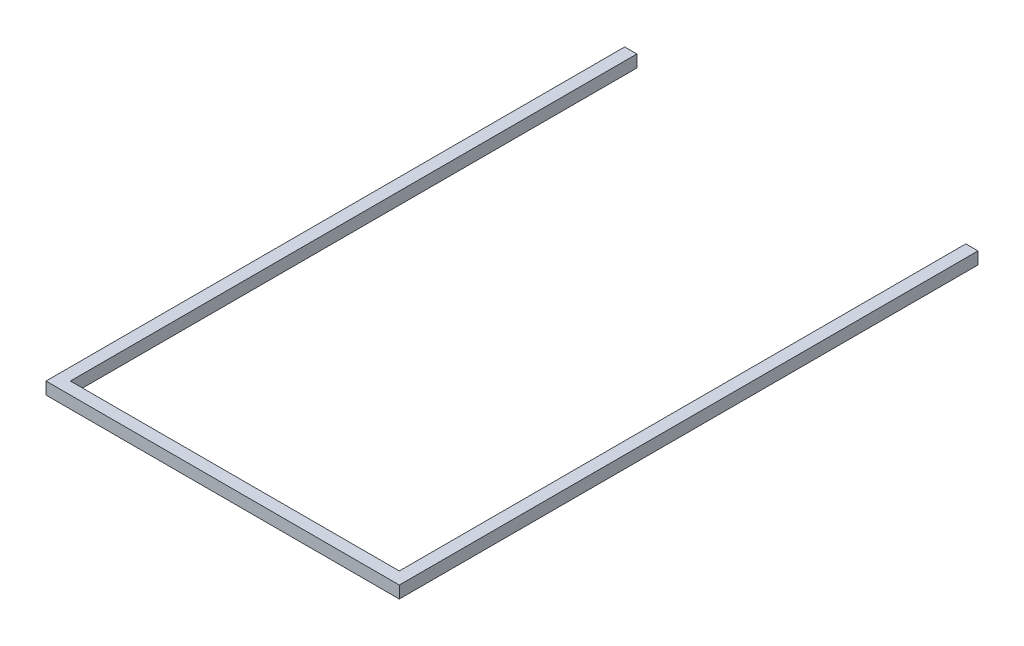
ISO-10303-21;
HEADER;
FILE_DESCRIPTION(('STEP AP214'),'2;1');
FILE_NAME('part.step','',(''),(''),'','','');
FILE_SCHEMA(('AUTOMOTIVE_DESIGN { 1 0 10303 214 1 1 1 1 }'));
ENDSEC;
DATA;
#1=APPLICATION_CONTEXT('core data for automotive mechanical design processes');
#2=APPLICATION_PROTOCOL_DEFINITION('international standard','automotive_design',2000,#1);
#3=PRODUCT_CONTEXT('',#1,'mechanical');
#4=PRODUCT('Part','Part','',(#3));
#5=PRODUCT_RELATED_PRODUCT_CATEGORY('part','',(#4));
#6=PRODUCT_DEFINITION_FORMATION('','',#4);
#7=PRODUCT_DEFINITION_CONTEXT('part definition',#1,'design');
#8=PRODUCT_DEFINITION('design','',#6,#7);
#9=PRODUCT_DEFINITION_SHAPE('','',#8);
#10=(LENGTH_UNIT() NAMED_UNIT(*) SI_UNIT(.MILLI.,.METRE.));
#11=(NAMED_UNIT(*) PLANE_ANGLE_UNIT() SI_UNIT($,.RADIAN.));
#12=(NAMED_UNIT(*) SI_UNIT($,.STERADIAN.) SOLID_ANGLE_UNIT());
#13=UNCERTAINTY_MEASURE_WITH_UNIT(LENGTH_MEASURE(1.E-05),#10,'distance_accuracy_value','');
#14=(GEOMETRIC_REPRESENTATION_CONTEXT(3) GLOBAL_UNCERTAINTY_ASSIGNED_CONTEXT((#13)) GLOBAL_UNIT_ASSIGNED_CONTEXT((#10,
#11,#12)) REPRESENTATION_CONTEXT('',''));
#15=CARTESIAN_POINT('',(0.,0.,0.));
#16=DIRECTION('',(0.,0.,1.));
#17=DIRECTION('',(1.,0.,0.));
#18=AXIS2_PLACEMENT_3D('',#15,#16,#17);
#19=CARTESIAN_POINT('',(-61.1442597325954,20.,-891.787813670094));
#20=DIRECTION('',(0.,0.,1.));
#21=DIRECTION('',(1.,0.,0.));
#22=AXIS2_PLACEMENT_3D('',#19,#20,#21);
#23=PLANE('',#22);
#24=DIRECTION('',(-1.,0.,0.));
#25=VECTOR('',#24,1.);
#26=CARTESIAN_POINT('',(-61.1442597325954,0.,-891.787813670094));
#27=LINE('',#26,#25);
#28=CARTESIAN_POINT('',(-61.1442597325954,0.,-891.787813670094));
#29=VERTEX_POINT('',#28);
#30=CARTESIAN_POINT('',(-81.1442597325955,0.,-891.787813670094));
#31=VERTEX_POINT('',#30);
#32=EDGE_CURVE('E129',#29,#31,#27,.T.);
#33=ORIENTED_EDGE('',*,*,#32,.T.);
#34=DIRECTION('',(0.,-1.,0.));
#35=VECTOR('',#34,1.);
#36=CARTESIAN_POINT('',(-81.1442597325955,20.,-891.787813670094));
#37=LINE('',#36,#35);
#38=CARTESIAN_POINT('',(-81.1442597325955,20.,-891.787813670094));
#39=VERTEX_POINT('',#38);
#40=EDGE_CURVE('E11',#39,#31,#37,.T.);
#41=ORIENTED_EDGE('',*,*,#40,.F.);
#42=DIRECTION('',(-1.,0.,0.));
#43=VECTOR('',#42,1.);
#44=CARTESIAN_POINT('',(-61.1442597325954,20.,-891.787813670094));
#45=LINE('',#44,#43);
#46=CARTESIAN_POINT('',(-61.1442597325954,20.,-891.787813670094));
#47=VERTEX_POINT('',#46);
#48=EDGE_CURVE('E143',#47,#39,#45,.T.);
#49=ORIENTED_EDGE('',*,*,#48,.F.);
#50=DIRECTION('',(0.,-1.,0.));
#51=VECTOR('',#50,1.);
#52=CARTESIAN_POINT('',(-61.1442597325954,20.,-891.787813670094));
#53=LINE('',#52,#51);
#54=EDGE_CURVE('E125',#47,#29,#53,.T.);
#55=ORIENTED_EDGE('',*,*,#54,.T.);
#56=EDGE_LOOP('',(#33,#41,#49,#55));
#57=FACE_BOUND('',#56,.T.);
#58=ADVANCED_FACE('F33',(#57),#23,.F.);
#59=CARTESIAN_POINT('',(-81.1442597325955,20.,-891.787813670094));
#60=DIRECTION('',(1.,0.,0.));
#61=DIRECTION('',(0.,0.,-1.));
#62=AXIS2_PLACEMENT_3D('',#59,#60,#61);
#63=PLANE('',#62);
#64=DIRECTION('',(0.,0.,1.));
#65=VECTOR('',#64,1.);
#66=CARTESIAN_POINT('',(-81.1442597325955,0.,-891.787813670094));
#67=LINE('',#66,#65);
#68=CARTESIAN_POINT('',(-81.1442597325954,0.,58.2121863299054));
#69=VERTEX_POINT('',#68);
#70=EDGE_CURVE('E132',#31,#69,#67,.T.);
#71=ORIENTED_EDGE('',*,*,#70,.T.);
#72=DIRECTION('',(0.,-1.,0.));
#73=VECTOR('',#72,1.);
#74=CARTESIAN_POINT('',(-81.1442597325954,20.,58.2121863299054));
#75=LINE('',#74,#73);
#76=CARTESIAN_POINT('',(-81.1442597325954,20.,58.2121863299054));
#77=VERTEX_POINT('',#76);
#78=EDGE_CURVE('E41',#77,#69,#75,.T.);
#79=ORIENTED_EDGE('',*,*,#78,.F.);
#80=DIRECTION('',(0.,0.,1.));
#81=VECTOR('',#80,1.);
#82=CARTESIAN_POINT('',(-81.1442597325955,20.,-891.787813670094));
#83=LINE('',#82,#81);
#84=EDGE_CURVE('E92',#39,#77,#83,.T.);
#85=ORIENTED_EDGE('',*,*,#84,.F.);
#86=ORIENTED_EDGE('',*,*,#40,.T.);
#87=EDGE_LOOP('',(#71,#79,#85,#86));
#88=FACE_BOUND('',#87,.T.);
#89=ADVANCED_FACE('F178',(#88),#63,.F.);
#90=CARTESIAN_POINT('',(-81.1442597325954,20.,58.2121863299054));
#91=DIRECTION('',(0.,0.,-1.));
#92=DIRECTION('',(-1.,0.,0.));
#93=AXIS2_PLACEMENT_3D('',#90,#91,#92);
#94=PLANE('',#93);
#95=DIRECTION('',(1.,0.,0.));
#96=VECTOR('',#95,1.);
#97=CARTESIAN_POINT('',(-81.1442597325954,0.,58.2121863299054));
#98=LINE('',#97,#96);
#99=CARTESIAN_POINT('',(498.855740267405,0.,58.2121863299054));
#100=VERTEX_POINT('',#99);
#101=EDGE_CURVE('E134',#69,#100,#98,.T.);
#102=ORIENTED_EDGE('',*,*,#101,.T.);
#103=DIRECTION('',(0.,-1.,0.));
#104=VECTOR('',#103,1.);
#105=CARTESIAN_POINT('',(498.855740267405,20.,58.2121863299054));
#106=LINE('',#105,#104);
#107=CARTESIAN_POINT('',(498.855740267405,20.,58.2121863299054));
#108=VERTEX_POINT('',#107);
#109=EDGE_CURVE('E150',#108,#100,#106,.T.);
#110=ORIENTED_EDGE('',*,*,#109,.F.);
#111=DIRECTION('',(1.,0.,0.));
#112=VECTOR('',#111,1.);
#113=CARTESIAN_POINT('',(-81.1442597325954,20.,58.2121863299054));
#114=LINE('',#113,#112);
#115=EDGE_CURVE('E158',#77,#108,#114,.T.);
#116=ORIENTED_EDGE('',*,*,#115,.F.);
#117=ORIENTED_EDGE('',*,*,#78,.T.);
#118=EDGE_LOOP('',(#102,#110,#116,#117));
#119=FACE_BOUND('',#118,.T.);
#120=ADVANCED_FACE('F156',(#119),#94,.F.);
#121=CARTESIAN_POINT('',(498.855740267405,20.,58.2121863299054));
#122=DIRECTION('',(-1.,0.,0.));
#123=DIRECTION('',(0.,0.,1.));
#124=AXIS2_PLACEMENT_3D('',#121,#122,#123);
#125=PLANE('',#124);
#126=DIRECTION('',(0.,0.,-1.));
#127=VECTOR('',#126,1.);
#128=CARTESIAN_POINT('',(498.855740267405,0.,58.2121863299054));
#129=LINE('',#128,#127);
#130=CARTESIAN_POINT('',(498.855740267405,0.,-891.787813670095));
#131=VERTEX_POINT('',#130);
#132=EDGE_CURVE('E136',#100,#131,#129,.T.);
#133=ORIENTED_EDGE('',*,*,#132,.T.);
#134=DIRECTION('',(0.,-1.,0.));
#135=VECTOR('',#134,1.);
#136=CARTESIAN_POINT('',(498.855740267405,20.,-891.787813670095));
#137=LINE('',#136,#135);
#138=CARTESIAN_POINT('',(498.855740267405,20.,-891.787813670095));
#139=VERTEX_POINT('',#138);
#140=EDGE_CURVE('E147',#139,#131,#137,.T.);
#141=ORIENTED_EDGE('',*,*,#140,.F.);
#142=DIRECTION('',(0.,0.,-1.));
#143=VECTOR('',#142,1.);
#144=CARTESIAN_POINT('',(498.855740267405,20.,58.2121863299054));
#145=LINE('',#144,#143);
#146=EDGE_CURVE('E170',#108,#139,#145,.T.);
#147=ORIENTED_EDGE('',*,*,#146,.F.);
#148=ORIENTED_EDGE('',*,*,#109,.T.);
#149=EDGE_LOOP('',(#133,#141,#147,#148));
#150=FACE_BOUND('',#149,.T.);
#151=ADVANCED_FACE('F166',(#150),#125,.F.);
#152=CARTESIAN_POINT('',(498.855740267405,20.,-891.787813670095));
#153=DIRECTION('',(0.,0.,1.));
#154=DIRECTION('',(1.,0.,0.));
#155=AXIS2_PLACEMENT_3D('',#152,#153,#154);
#156=PLANE('',#155);
#157=DIRECTION('',(-1.,0.,0.));
#158=VECTOR('',#157,1.);
#159=CARTESIAN_POINT('',(498.855740267405,0.,-891.787813670095));
#160=LINE('',#159,#158);
#161=CARTESIAN_POINT('',(478.855740267404,0.,-891.787813670095));
#162=VERTEX_POINT('',#161);
#163=EDGE_CURVE('E138',#131,#162,#160,.T.);
#164=ORIENTED_EDGE('',*,*,#163,.T.);
#165=DIRECTION('',(0.,-1.,0.));
#166=VECTOR('',#165,1.);
#167=CARTESIAN_POINT('',(478.855740267404,20.,-891.787813670095));
#168=LINE('',#167,#166);
#169=CARTESIAN_POINT('',(478.855740267404,20.,-891.787813670095));
#170=VERTEX_POINT('',#169);
#171=EDGE_CURVE('E120',#170,#162,#168,.T.);
#172=ORIENTED_EDGE('',*,*,#171,.F.);
#173=DIRECTION('',(-1.,0.,0.));
#174=VECTOR('',#173,1.);
#175=CARTESIAN_POINT('',(498.855740267405,20.,-891.787813670095));
#176=LINE('',#175,#174);
#177=EDGE_CURVE('E111',#139,#170,#176,.T.);
#178=ORIENTED_EDGE('',*,*,#177,.F.);
#179=ORIENTED_EDGE('',*,*,#140,.T.);
#180=EDGE_LOOP('',(#164,#172,#178,#179));
#181=FACE_BOUND('',#180,.T.);
#182=ADVANCED_FACE('F169',(#181),#156,.F.);
#183=CARTESIAN_POINT('',(478.855740267404,20.,-891.787813670095));
#184=DIRECTION('',(1.,0.,0.));
#185=DIRECTION('',(0.,0.,-1.));
#186=AXIS2_PLACEMENT_3D('',#183,#184,#185);
#187=PLANE('',#186);
#188=DIRECTION('',(0.,0.,1.));
#189=VECTOR('',#188,1.);
#190=CARTESIAN_POINT('',(478.855740267404,0.,-891.787813670095));
#191=LINE('',#190,#189);
#192=CARTESIAN_POINT('',(478.855740267405,0.,38.2121863299052));
#193=VERTEX_POINT('',#192);
#194=EDGE_CURVE('E119',#162,#193,#191,.T.);
#195=ORIENTED_EDGE('',*,*,#194,.T.);
#196=DIRECTION('',(0.,-1.,0.));
#197=VECTOR('',#196,1.);
#198=CARTESIAN_POINT('',(478.855740267405,20.,38.2121863299052));
#199=LINE('',#198,#197);
#200=CARTESIAN_POINT('',(478.855740267405,20.,38.2121863299052));
#201=VERTEX_POINT('',#200);
#202=EDGE_CURVE('E116',#201,#193,#199,.T.);
#203=ORIENTED_EDGE('',*,*,#202,.F.);
#204=DIRECTION('',(0.,0.,1.));
#205=VECTOR('',#204,1.);
#206=CARTESIAN_POINT('',(478.855740267404,20.,-891.787813670095));
#207=LINE('',#206,#205);
#208=EDGE_CURVE('E105',#170,#201,#207,.T.);
#209=ORIENTED_EDGE('',*,*,#208,.F.);
#210=ORIENTED_EDGE('',*,*,#171,.T.);
#211=EDGE_LOOP('',(#195,#203,#209,#210));
#212=FACE_BOUND('',#211,.T.);
#213=ADVANCED_FACE('F117',(#212),#187,.F.);
#214=CARTESIAN_POINT('',(478.855740267405,20.,38.2121863299052));
#215=DIRECTION('',(0.,0.,1.));
#216=DIRECTION('',(1.,0.,0.));
#217=AXIS2_PLACEMENT_3D('',#214,#215,#216);
#218=PLANE('',#217);
#219=DIRECTION('',(-1.,0.,0.));
#220=VECTOR('',#219,1.);
#221=CARTESIAN_POINT('',(478.855740267405,0.,38.2121863299052));
#222=LINE('',#221,#220);
#223=CARTESIAN_POINT('',(-61.1442597325954,0.,38.2121863299054));
#224=VERTEX_POINT('',#223);
#225=EDGE_CURVE('E78',#193,#224,#222,.T.);
#226=ORIENTED_EDGE('',*,*,#225,.T.);
#227=DIRECTION('',(0.,-1.,0.));
#228=VECTOR('',#227,1.);
#229=CARTESIAN_POINT('',(-61.1442597325954,20.,38.2121863299054));
#230=LINE('',#229,#228);
#231=CARTESIAN_POINT('',(-61.1442597325954,20.,38.2121863299054));
#232=VERTEX_POINT('',#231);
#233=EDGE_CURVE('E121',#232,#224,#230,.T.);
#234=ORIENTED_EDGE('',*,*,#233,.F.);
#235=DIRECTION('',(-1.,0.,0.));
#236=VECTOR('',#235,1.);
#237=CARTESIAN_POINT('',(478.855740267405,20.,38.2121863299052));
#238=LINE('',#237,#236);
#239=EDGE_CURVE('E109',#201,#232,#238,.T.);
#240=ORIENTED_EDGE('',*,*,#239,.F.);
#241=ORIENTED_EDGE('',*,*,#202,.T.);
#242=EDGE_LOOP('',(#226,#234,#240,#241));
#243=FACE_BOUND('',#242,.T.);
#244=ADVANCED_FACE('F123',(#243),#218,.F.);
#245=CARTESIAN_POINT('',(-61.1442597325954,20.,38.2121863299054));
#246=DIRECTION('',(-1.,0.,0.));
#247=DIRECTION('',(0.,0.,1.));
#248=AXIS2_PLACEMENT_3D('',#245,#246,#247);
#249=PLANE('',#248);
#250=DIRECTION('',(0.,0.,-1.));
#251=VECTOR('',#250,1.);
#252=CARTESIAN_POINT('',(-61.1442597325954,0.,38.2121863299054));
#253=LINE('',#252,#251);
#254=EDGE_CURVE('E84',#224,#29,#253,.T.);
#255=ORIENTED_EDGE('',*,*,#254,.T.);
#256=ORIENTED_EDGE('',*,*,#54,.F.);
#257=DIRECTION('',(0.,0.,-1.));
#258=VECTOR('',#257,1.);
#259=CARTESIAN_POINT('',(-61.1442597325954,20.,38.2121863299054));
#260=LINE('',#259,#258);
#261=EDGE_CURVE('E49',#232,#47,#260,.T.);
#262=ORIENTED_EDGE('',*,*,#261,.F.);
#263=ORIENTED_EDGE('',*,*,#233,.T.);
#264=EDGE_LOOP('',(#255,#256,#262,#263));
#265=FACE_BOUND('',#264,.T.);
#266=ADVANCED_FACE('F194',(#265),#249,.F.);
#267=CARTESIAN_POINT('',(0.,20.,0.));
#268=DIRECTION('',(0.,1.,0.));
#269=DIRECTION('',(0.,0.,1.));
#270=AXIS2_PLACEMENT_3D('',#267,#268,#269);
#271=PLANE('',#270);
#272=ORIENTED_EDGE('',*,*,#48,.T.);
#273=ORIENTED_EDGE('',*,*,#84,.T.);
#274=ORIENTED_EDGE('',*,*,#115,.T.);
#275=ORIENTED_EDGE('',*,*,#146,.T.);
#276=ORIENTED_EDGE('',*,*,#177,.T.);
#277=ORIENTED_EDGE('',*,*,#208,.T.);
#278=ORIENTED_EDGE('',*,*,#239,.T.);
#279=ORIENTED_EDGE('',*,*,#261,.T.);
#280=EDGE_LOOP('',(#272,#273,#274,#275,#276,#277,#278,#279));
#281=FACE_BOUND('',#280,.T.);
#282=ADVANCED_FACE('F107',(#281),#271,.T.);
#283=CARTESIAN_POINT('',(0.,0.,0.));
#284=DIRECTION('',(0.,1.,0.));
#285=DIRECTION('',(0.,0.,1.));
#286=AXIS2_PLACEMENT_3D('',#283,#284,#285);
#287=PLANE('',#286);
#288=ORIENTED_EDGE('',*,*,#32,.F.);
#289=ORIENTED_EDGE('',*,*,#254,.F.);
#290=ORIENTED_EDGE('',*,*,#225,.F.);
#291=ORIENTED_EDGE('',*,*,#194,.F.);
#292=ORIENTED_EDGE('',*,*,#163,.F.);
#293=ORIENTED_EDGE('',*,*,#132,.F.);
#294=ORIENTED_EDGE('',*,*,#101,.F.);
#295=ORIENTED_EDGE('',*,*,#70,.F.);
#296=EDGE_LOOP('',(#288,#289,#290,#291,#292,#293,#294,#295));
#297=FACE_BOUND('',#296,.T.);
#298=ADVANCED_FACE('F162',(#297),#287,.F.);
#299=CLOSED_SHELL('',(#58,#89,#120,#151,#182,#213,#244,#266,#282,#298));
#300=MANIFOLD_SOLID_BREP('B2',#299);
#301=ADVANCED_BREP_SHAPE_REPRESENTATION('',(#18,#300),#14);
#302=SHAPE_DEFINITION_REPRESENTATION(#9,#301);
ENDSEC;
END-ISO-10303-21;
